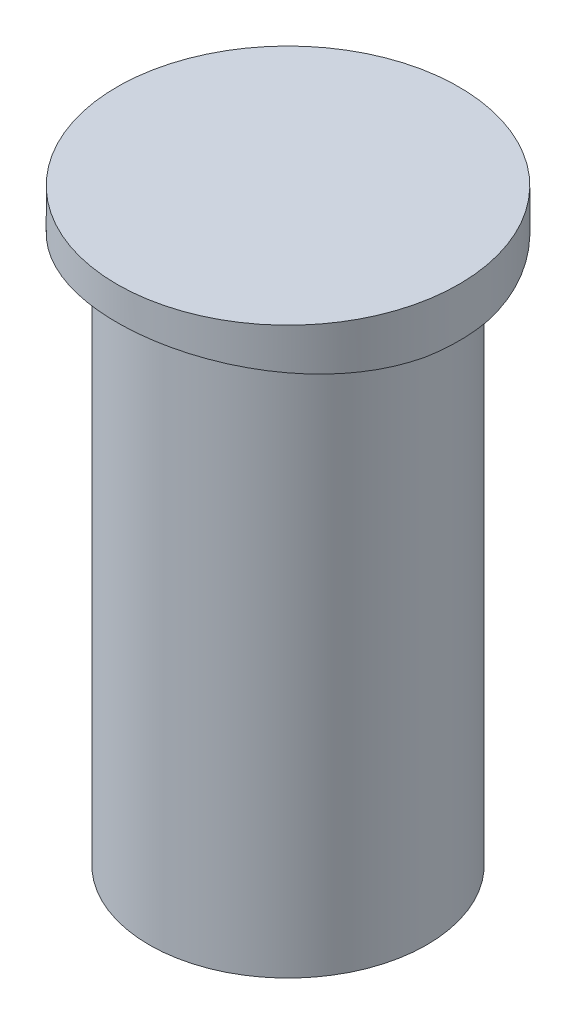
ISO-10303-21;
HEADER;
FILE_DESCRIPTION(('STEP AP214'),'2;1');
FILE_NAME('part.step','',(''),(''),'','','');
FILE_SCHEMA(('AUTOMOTIVE_DESIGN { 1 0 10303 214 1 1 1 1 }'));
ENDSEC;
DATA;
#1=APPLICATION_CONTEXT('core data for automotive mechanical design processes');
#2=APPLICATION_PROTOCOL_DEFINITION('international standard','automotive_design',2000,#1);
#3=PRODUCT_CONTEXT('',#1,'mechanical');
#4=PRODUCT('Part','Part','',(#3));
#5=PRODUCT_RELATED_PRODUCT_CATEGORY('part','',(#4));
#6=PRODUCT_DEFINITION_FORMATION('','',#4);
#7=PRODUCT_DEFINITION_CONTEXT('part definition',#1,'design');
#8=PRODUCT_DEFINITION('design','',#6,#7);
#9=PRODUCT_DEFINITION_SHAPE('','',#8);
#10=(LENGTH_UNIT() NAMED_UNIT(*) SI_UNIT(.MILLI.,.METRE.));
#11=(NAMED_UNIT(*) PLANE_ANGLE_UNIT() SI_UNIT($,.RADIAN.));
#12=(NAMED_UNIT(*) SI_UNIT($,.STERADIAN.) SOLID_ANGLE_UNIT());
#13=UNCERTAINTY_MEASURE_WITH_UNIT(LENGTH_MEASURE(1.E-05),#10,'distance_accuracy_value','');
#14=(GEOMETRIC_REPRESENTATION_CONTEXT(3) GLOBAL_UNCERTAINTY_ASSIGNED_CONTEXT((#13)) GLOBAL_UNIT_ASSIGNED_CONTEXT((#10,
#11,#12)) REPRESENTATION_CONTEXT('',''));
#15=CARTESIAN_POINT('',(0.,0.,0.));
#16=DIRECTION('',(0.,0.,1.));
#17=DIRECTION('',(1.,0.,0.));
#18=AXIS2_PLACEMENT_3D('',#15,#16,#17);
#19=CARTESIAN_POINT('',(0.,26.2128,0.));
#20=DIRECTION('',(0.,-1.,0.));
#21=DIRECTION('',(0.,0.,-1.));
#22=AXIS2_PLACEMENT_3D('',#19,#20,#21);
#23=CYLINDRICAL_SURFACE('',#22,7.62);
#24=CARTESIAN_POINT('',(0.,26.2128,0.));
#25=DIRECTION('',(0.,1.,0.));
#26=DIRECTION('',(0.,0.,1.));
#27=AXIS2_PLACEMENT_3D('',#24,#25,#26);
#28=CIRCLE('',#27,7.62);
#29=CARTESIAN_POINT('',(0.,26.2128,7.62));
#30=VERTEX_POINT('',#29);
#31=EDGE_CURVE('E84',#30,#30,#28,.T.);
#32=ORIENTED_EDGE('',*,*,#31,.F.);
#33=EDGE_LOOP('',(#32));
#34=FACE_BOUND('',#33,.T.);
#35=CARTESIAN_POINT('',(0.,24.0284,0.));
#36=DIRECTION('',(0.,-1.,0.));
#37=DIRECTION('',(0.,0.,-1.));
#38=AXIS2_PLACEMENT_3D('',#35,#36,#37);
#39=CIRCLE('',#38,7.62);
#40=CARTESIAN_POINT('',(7.49777712125401,24.0284,-1.35931535708235));
#41=VERTEX_POINT('',#40);
#42=CARTESIAN_POINT('',(7.49777712125401,24.0284,1.35931535708235));
#43=VERTEX_POINT('',#42);
#44=EDGE_CURVE('E12',#41,#43,#39,.T.);
#45=ORIENTED_EDGE('',*,*,#44,.F.);
#46=CARTESIAN_POINT('',(7.60145996562146,24.0084094535309,-0.531231014770565));
#47=CARTESIAN_POINT('',(7.58664521906398,24.0112734826788,-0.743574984765963));
#48=CARTESIAN_POINT('',(7.5628865936081,24.0158905101815,-0.955261795898511));
#49=CARTESIAN_POINT('',(7.49778431421236,24.0284160184141,-1.37578771761263));
#50=CARTESIAN_POINT('',(7.4564429971873,24.0363240617322,-1.58462720282661));
#51=CARTESIAN_POINT('',(7.35654473256903,24.0552045585585,-1.99768971893656));
#52=CARTESIAN_POINT('',(7.29801224043028,24.0661726578554,-2.20191886688924));
#53=CARTESIAN_POINT('',(7.16416843573644,24.0908520997637,-2.60463188077035));
#54=CARTESIAN_POINT('',(7.08885698679914,24.1045634646727,-2.80311569998495));
#55=CARTESIAN_POINT('',(6.92203005844817,24.134332929158,-3.19293668515689));
#56=CARTESIAN_POINT('',(6.83051669414457,24.1503907223677,-3.38427478002308));
#57=CARTESIAN_POINT('',(6.63191048182801,24.1844025100194,-3.75859960903848));
#58=CARTESIAN_POINT('',(6.52481187745667,24.2023572044015,-3.94158322453849));
#59=CARTESIAN_POINT('',(6.2958536908123,24.2396465872693,-4.2978423859162));
#60=CARTESIAN_POINT('',(6.17399849173473,24.2589808652758,-4.47112079230467));
#61=CARTESIAN_POINT('',(5.91629603702723,24.298503010515,-4.80693817574346));
#62=CARTESIAN_POINT('',(5.78044357466376,24.3186911937273,-4.96947311924289));
#63=CARTESIAN_POINT('',(5.49408753868613,24.3595877226154,-5.28443120625521));
#64=CARTESIAN_POINT('',(5.34343528610684,24.3802993708511,-5.43671877424667));
#65=CARTESIAN_POINT('',(5.02976977722108,24.4214448286672,-5.72814650576097));
#66=CARTESIAN_POINT('',(4.86675195085451,24.4418785322023,-5.86728176537054));
#67=CARTESIAN_POINT('',(4.52952364115873,24.481886749871,-6.1313683670372));
#68=CARTESIAN_POINT('',(4.3553139142099,24.5014613219169,-6.25632066604314));
#69=CARTESIAN_POINT('',(3.99687773153306,24.5392047918952,-6.49116907557979));
#70=CARTESIAN_POINT('',(3.81265119740503,24.5573736788227,-6.60106506824337));
#71=CARTESIAN_POINT('',(3.43478931715503,24.5918556968243,-6.80535900911019));
#72=CARTESIAN_POINT('',(3.2411233502858,24.6081621232035,-6.89970147474016));
#73=CARTESIAN_POINT('',(2.84633505769055,24.6383827896656,-7.07171399153072));
#74=CARTESIAN_POINT('',(2.64521252956916,24.652296964757,-7.14938358974626));
#75=CARTESIAN_POINT('',(2.23701641141498,24.677331020824,-7.28742494168067));
#76=CARTESIAN_POINT('',(2.02994472322203,24.6884517839666,-7.34780215722753));
#77=CARTESIAN_POINT('',(1.61121901878155,24.7075883976523,-7.45083043529028));
#78=CARTESIAN_POINT('',(1.39956346541083,24.7156031890887,-7.49347545165672));
#79=CARTESIAN_POINT('',(0.976440876067232,24.7281973430518,-7.56016907171225));
#80=CARTESIAN_POINT('',(0.765016978891261,24.7328255662944,-7.5844823252036));
#81=CARTESIAN_POINT('',(0.340827390531902,24.7387076089555,-7.61534360243806));
#82=CARTESIAN_POINT('',(0.128061693506159,24.7399614136711,-7.62189154877533));
#83=CARTESIAN_POINT('',(-0.297247391674014,24.7390591400649,-7.61716932123029));
#84=CARTESIAN_POINT('',(-0.509790795998619,24.7369033299535,-7.60590054886423));
#85=CARTESIAN_POINT('',(-0.93313618240053,24.729243052376,-7.56563733412641));
#86=CARTESIAN_POINT('',(-1.14393812198026,24.7237385034325,-7.53664246046587));
#87=CARTESIAN_POINT('',(-1.56015379918455,24.7096078223504,-7.46154047911077));
#88=CARTESIAN_POINT('',(-1.76560048935044,24.7010138822003,-7.41560972377174));
#89=CARTESIAN_POINT('',(-2.17194515067435,24.6809287035489,-7.3069353802776));
#90=CARTESIAN_POINT('',(-2.37284116059095,24.6694362407999,-7.24418468718802));
#91=CARTESIAN_POINT('',(-2.76862844701447,24.6438688371208,-7.10234417085837));
#92=CARTESIAN_POINT('',(-2.96351918821217,24.6297936667416,-7.023252895834));
#93=CARTESIAN_POINT('',(-3.34587544223105,24.5994506028597,-6.84935101995592));
#94=CARTESIAN_POINT('',(-3.53334408017868,24.5831836452056,-6.75454712411903));
#95=CARTESIAN_POINT('',(-3.90155766296138,24.5487172360085,-6.54882991348605));
#96=CARTESIAN_POINT('',(-4.08221499307108,24.5304998370324,-6.43776277992279));
#97=CARTESIAN_POINT('',(-4.43349444909584,24.4927772669481,-6.20107785920705));
#98=CARTESIAN_POINT('',(-4.60412006664457,24.473272548981,-6.07546518051897));
#99=CARTESIAN_POINT('',(-4.9343312112821,24.4334957163316,-5.8104738747348));
#100=CARTESIAN_POINT('',(-5.09391268176615,24.4132233238618,-5.67109023460912));
#101=CARTESIAN_POINT('',(-5.40085063895677,24.3724802972766,-5.37959041624126));
#102=CARTESIAN_POINT('',(-5.54821145315523,24.3520097362275,-5.22747878380961));
#103=CARTESIAN_POINT('',(-5.83193516713075,24.3111155473659,-4.90908243146261));
#104=CARTESIAN_POINT('',(-5.96809610901122,24.2906973946312,-4.74261696643934));
#105=CARTESIAN_POINT('',(-6.22586671702448,24.250817777657,-4.39876534716527));
#106=CARTESIAN_POINT('',(-6.34748170319889,24.2313559651892,-4.2213832217482));
#107=CARTESIAN_POINT('',(-6.57538372329734,24.1939347641777,-3.85680649951189));
#108=CARTESIAN_POINT('',(-6.68166624589128,24.1759758184785,-3.66960903668853));
#109=CARTESIAN_POINT('',(-6.87804165084899,24.1420958829046,-3.28682120914972));
#110=CARTESIAN_POINT('',(-6.96814113563748,24.126174062681,-3.09123430772443));
#111=CARTESIAN_POINT('',(-7.12670842856968,24.0976932914503,-2.70471048194568));
#112=CARTESIAN_POINT('',(-7.19613749186226,24.0849915409202,-2.51417774456657));
#113=CARTESIAN_POINT('',(-7.3196229358713,24.0621348796413,-2.12805223728751));
#114=CARTESIAN_POINT('',(-7.37368020078557,24.0519798224087,-1.93245975913414));
#115=CARTESIAN_POINT('',(-7.46607621335406,24.0344843112086,-1.53729953509802));
#116=CARTESIAN_POINT('',(-7.50440180194003,24.0271462138733,-1.33772860706581));
#117=CARTESIAN_POINT('',(-7.56502214508634,24.0154766511921,-0.936048412085034));
#118=CARTESIAN_POINT('',(-7.5873143461277,24.0111456647703,-0.733938746023273));
#119=CARTESIAN_POINT('',(-7.60145996562146,24.0084094535309,-0.531231014770655));
#120=B_SPLINE_CURVE_WITH_KNOTS('',3,(#46,#47,#48,#49,#50,#51,#52,#53,#54,#55,#56,#57,#58,#59,
#60,#61,#62,#63,#64,#65,#66,#67,#68,#69,#70,#71,#72,#73,#74,#75,#76,#77,#78,#79,#80,#81,#82,#83,
#84,#85,#86,#87,#88,#89,#90,#91,#92,#93,#94,#95,#96,#97,#98,#99,#100,#101,#102,#103,#104,#105,
#106,#107,#108,#109,#110,#111,#112,#113,#114,#115,#116,#117,#118,#119),.UNSPECIFIED.,.F.,.F.,(4,
2,2,2,2,2,2,2,2,2,2,2,2,2,2,2,2,2,2,2,2,2,2,2,2,2,2,2,2,2,2,2,2,2,2,2,4),(0.,0.638431030366087,
1.27677723339447,1.91421971387715,2.55166737578985,3.18903188215546,3.82663239736826,
4.46404398659672,5.1016935435668,5.74657434370566,6.39169465067711,7.03677140436057,
7.68185320768874,8.32918856165005,8.97654149928362,9.62368974334936,10.2710584650214,
10.9088922870554,11.5467288882133,12.1845153177372,12.8223172656807,13.4536571966656,
14.0852642342936,14.7169274114032,15.3483217308366,15.9861280455205,16.6237110351295,
17.2615269846709,17.8991161022696,18.5464271822961,19.1935007859279,19.8407643939005,
20.4877633256872,21.0966702579752,21.7055421583747,22.3149223287841,22.9243995291865),.UNSPECIFIED.);
#121=CARTESIAN_POINT('',(-7.49777712125401,24.0284,-1.35931535708235));
#122=VERTEX_POINT('',#121);
#123=EDGE_CURVE('E89',#41,#122,#120,.T.);
#124=ORIENTED_EDGE('',*,*,#123,.T.);
#125=CARTESIAN_POINT('',(-7.49777712125401,24.0284,1.35931535708235));
#126=VERTEX_POINT('',#125);
#127=EDGE_CURVE('E64',#126,#122,#39,.T.);
#128=ORIENTED_EDGE('',*,*,#127,.F.);
#129=CARTESIAN_POINT('',(-7.60145996562146,24.0084094535309,0.531231014770655));
#130=CARTESIAN_POINT('',(-7.58664521906397,24.0112734826788,0.743574984766052));
#131=CARTESIAN_POINT('',(-7.56288659360809,24.0158905101815,0.9552617958986));
#132=CARTESIAN_POINT('',(-7.49778431421234,24.0284160184141,1.37578771761272));
#133=CARTESIAN_POINT('',(-7.45644299718728,24.0363240617321,1.5846272028267));
#134=CARTESIAN_POINT('',(-7.35654473256901,24.0552045585585,1.99768971893665));
#135=CARTESIAN_POINT('',(-7.29801224043026,24.0661726578554,2.20191886688933));
#136=CARTESIAN_POINT('',(-7.16416843573641,24.0908520997637,2.60463188077043));
#137=CARTESIAN_POINT('',(-7.08885698679911,24.1045634646727,2.80311569998503));
#138=CARTESIAN_POINT('',(-6.92203005844813,24.1343329291581,3.19293668515698));
#139=CARTESIAN_POINT('',(-6.83051669414453,24.1503907223677,3.38427478002316));
#140=CARTESIAN_POINT('',(-6.63191048182796,24.1844025100194,3.75859960903856));
#141=CARTESIAN_POINT('',(-6.52481187745662,24.2023572044015,3.94158322453857));
#142=CARTESIAN_POINT('',(-6.29585369081225,24.2396465872693,4.29784238591627));
#143=CARTESIAN_POINT('',(-6.17399849173468,24.2589808652758,4.47112079230475));
#144=CARTESIAN_POINT('',(-5.91629603702717,24.298503010515,4.80693817574353));
#145=CARTESIAN_POINT('',(-5.7804435746637,24.3186911937273,4.96947311924296));
#146=CARTESIAN_POINT('',(-5.49408753868606,24.3595877226154,5.28443120625527));
#147=CARTESIAN_POINT('',(-5.34343528610677,24.3802993708511,5.43671877424674));
#148=CARTESIAN_POINT('',(-5.02976977722101,24.4214448286672,5.72814650576103));
#149=CARTESIAN_POINT('',(-4.86675195085444,24.4418785322023,5.8672817653706));
#150=CARTESIAN_POINT('',(-4.52952364115866,24.481886749871,6.13136836703726));
#151=CARTESIAN_POINT('',(-4.35531391420982,24.5014613219169,6.2563206660432));
#152=CARTESIAN_POINT('',(-3.99687773153298,24.5392047918952,6.49116907557984));
#153=CARTESIAN_POINT('',(-3.81265119740494,24.5573736788227,6.60106506824341));
#154=CARTESIAN_POINT('',(-3.43478931715494,24.5918556968243,6.80535900911023));
#155=CARTESIAN_POINT('',(-3.24112335028571,24.6081621232035,6.89970147474021));
#156=CARTESIAN_POINT('',(-2.84633505769046,24.6383827896656,7.07171399153075));
#157=CARTESIAN_POINT('',(-2.64521252956907,24.6522969647571,7.14938358974629));
#158=CARTESIAN_POINT('',(-2.23701641141489,24.6773310208241,7.2874249416807));
#159=CARTESIAN_POINT('',(-2.02994472322194,24.6884517839666,7.34780215722756));
#160=CARTESIAN_POINT('',(-1.61121901878146,24.7075883976523,7.4508304352903));
#161=CARTESIAN_POINT('',(-1.39956346541073,24.7156031890887,7.49347545165674));
#162=CARTESIAN_POINT('',(-0.976440876067137,24.7281973430518,7.56016907171226));
#163=CARTESIAN_POINT('',(-0.765016978891166,24.7328255662944,7.58448232520361));
#164=CARTESIAN_POINT('',(-0.340827390531806,24.7387076089555,7.61534360243807));
#165=CARTESIAN_POINT('',(-0.128061693506062,24.7399614136711,7.62189154877533));
#166=CARTESIAN_POINT('',(0.297247391674112,24.7390591400649,7.61716932123028));
#167=CARTESIAN_POINT('',(0.509790795998718,24.7369033299535,7.60590054886422));
#168=CARTESIAN_POINT('',(0.933136182400627,24.729243052376,7.5656373341264));
#169=CARTESIAN_POINT('',(1.14393812198036,24.7237385034325,7.53664246046586));
#170=CARTESIAN_POINT('',(1.56015379918465,24.7096078223504,7.46154047911075));
#171=CARTESIAN_POINT('',(1.76560048935054,24.7010138822003,7.41560972377172));
#172=CARTESIAN_POINT('',(2.17194515067444,24.6809287035489,7.30693538027757));
#173=CARTESIAN_POINT('',(2.37284116059105,24.6694362407999,7.244184687188));
#174=CARTESIAN_POINT('',(2.76862844701456,24.6438688371208,7.10234417085834));
#175=CARTESIAN_POINT('',(2.96351918821226,24.6297936667416,7.02325289583397));
#176=CARTESIAN_POINT('',(3.34587544223114,24.5994506028597,6.84935101995588));
#177=CARTESIAN_POINT('',(3.53334408017877,24.5831836452056,6.75454712411899));
#178=CARTESIAN_POINT('',(3.90155766296146,24.5487172360085,6.548829913486));
#179=CARTESIAN_POINT('',(4.08221499307116,24.5304998370324,6.43776277992274));
#180=CARTESIAN_POINT('',(4.43349444909593,24.4927772669481,6.201077859207));
#181=CARTESIAN_POINT('',(4.60412006664465,24.473272548981,6.07546518051891));
#182=CARTESIAN_POINT('',(4.93433121128217,24.4334957163316,5.81047387473474));
#183=CARTESIAN_POINT('',(5.09391268176622,24.4132233238618,5.67109023460906));
#184=CARTESIAN_POINT('',(5.40085063895684,24.3724802972766,5.37959041624119));
#185=CARTESIAN_POINT('',(5.54821145315529,24.3520097362275,5.22747878380954));
#186=CARTESIAN_POINT('',(5.83193516713081,24.3111155473659,4.90908243146253));
#187=CARTESIAN_POINT('',(5.96809610901128,24.2906973946312,4.74261696643926));
#188=CARTESIAN_POINT('',(6.22586671702454,24.250817777657,4.39876534716519));
#189=CARTESIAN_POINT('',(6.34748170319895,24.2313559651892,4.22138322174811));
#190=CARTESIAN_POINT('',(6.5753837232974,24.1939347641777,3.85680649951181));
#191=CARTESIAN_POINT('',(6.68166624589133,24.1759758184785,3.66960903668844));
#192=CARTESIAN_POINT('',(6.87804165084903,24.1420958829046,3.28682120914963));
#193=CARTESIAN_POINT('',(6.96814113563752,24.126174062681,3.09123430772434));
#194=CARTESIAN_POINT('',(7.12670842856971,24.0976932914503,2.70471048194559));
#195=CARTESIAN_POINT('',(7.19613749186229,24.0849915409202,2.51417774456648));
#196=CARTESIAN_POINT('',(7.31962293587133,24.0621348796413,2.12805223728742));
#197=CARTESIAN_POINT('',(7.3736802007856,24.0519798224087,1.93245975913405));
#198=CARTESIAN_POINT('',(7.46607621335408,24.0344843112086,1.53729953509793));
#199=CARTESIAN_POINT('',(7.50440180194004,24.0271462138733,1.33772860706572));
#200=CARTESIAN_POINT('',(7.56502214508635,24.0154766511921,0.936048412084946));
#201=CARTESIAN_POINT('',(7.58731434612771,24.0111456647703,0.733938746023184));
#202=CARTESIAN_POINT('',(7.60145996562146,24.0084094535309,0.531231014770566));
#203=B_SPLINE_CURVE_WITH_KNOTS('',3,(#129,#130,#131,#132,#133,#134,#135,#136,#137,#138,#139,
#140,#141,#142,#143,#144,#145,#146,#147,#148,#149,#150,#151,#152,#153,#154,#155,#156,#157,#158,
#159,#160,#161,#162,#163,#164,#165,#166,#167,#168,#169,#170,#171,#172,#173,#174,#175,#176,#177,
#178,#179,#180,#181,#182,#183,#184,#185,#186,#187,#188,#189,#190,#191,#192,#193,#194,#195,#196,
#197,#198,#199,#200,#201,#202),.UNSPECIFIED.,.F.,.F.,(4,2,2,2,2,2,2,2,2,2,2,2,2,2,2,2,2,2,2,2,2,
2,2,2,2,2,2,2,2,2,2,2,2,2,2,2,4),(0.,0.638431030366088,1.27677723339447,1.91421971387715,
2.55166737578985,3.18903188215546,3.82663239736826,4.46404398659672,5.10169354356681,
5.74657434370566,6.39169465067711,7.03677140436057,7.68185320768875,8.32918856165006,
8.97654149928362,9.62368974334936,10.2710584650214,10.9088922870555,11.5467288882133,
12.1845153177372,12.8223172656807,13.4536571966656,14.0852642342936,14.7169274114032,
15.3483217308366,15.9861280455205,16.6237110351295,17.2615269846709,17.8991161022696,
18.5464271822961,19.1935007859279,19.8407643939005,20.4877633256872,21.0966702579752,
21.7055421583747,22.3149223287841,22.9243995291865),.UNSPECIFIED.);
#204=EDGE_CURVE('E88',#126,#43,#203,.T.);
#205=ORIENTED_EDGE('',*,*,#204,.T.);
#206=EDGE_LOOP('',(#45,#124,#128,#205));
#207=FACE_BOUND('',#206,.T.);
#208=ADVANCED_FACE('F54',(#34,#207),#23,.T.);
#209=CARTESIAN_POINT('',(0.,-15.1384,-7.62));
#210=DIRECTION('',(0.,0.,1.));
#211=DIRECTION('',(1.,0.,0.));
#212=AXIS2_PLACEMENT_3D('',#209,#210,#211);
#213=CYLINDRICAL_SURFACE('',#212,39.878);
#214=DIRECTION('',(0.,0.,1.));
#215=VECTOR('',#214,1.);
#216=CARTESIAN_POINT('',(7.49777712125401,24.0284,-7.62));
#217=LINE('',#216,#215);
#218=EDGE_CURVE('E63',#43,#41,#217,.F.);
#219=ORIENTED_EDGE('',*,*,#218,.F.);
#220=ORIENTED_EDGE('',*,*,#204,.F.);
#221=DIRECTION('',(0.,0.,1.));
#222=VECTOR('',#221,1.);
#223=CARTESIAN_POINT('',(-7.49777712125401,24.0284,-7.62));
#224=LINE('',#223,#222);
#225=EDGE_CURVE('E77',#122,#126,#224,.T.);
#226=ORIENTED_EDGE('',*,*,#225,.F.);
#227=ORIENTED_EDGE('',*,*,#123,.F.);
#228=EDGE_LOOP('',(#219,#220,#226,#227));
#229=FACE_BOUND('',#228,.T.);
#230=ADVANCED_FACE('F90',(#229),#213,.F.);
#231=CARTESIAN_POINT('',(0.,26.2128,0.));
#232=DIRECTION('',(0.,1.,0.));
#233=DIRECTION('',(0.,0.,1.));
#234=AXIS2_PLACEMENT_3D('',#231,#232,#233);
#235=PLANE('',#234);
#236=ORIENTED_EDGE('',*,*,#31,.T.);
#237=EDGE_LOOP('',(#236));
#238=FACE_BOUND('',#237,.T.);
#239=ADVANCED_FACE('F107',(#238),#235,.T.);
#240=CARTESIAN_POINT('',(0.,24.0284,0.));
#241=DIRECTION('',(0.,-1.,0.));
#242=DIRECTION('',(0.,0.,-1.));
#243=AXIS2_PLACEMENT_3D('',#240,#241,#242);
#244=PLANE('',#243);
#245=ORIENTED_EDGE('',*,*,#225,.T.);
#246=ORIENTED_EDGE('',*,*,#127,.T.);
#247=EDGE_LOOP('',(#245,#246));
#248=FACE_BOUND('',#247,.T.);
#249=ADVANCED_FACE('F79',(#248),#244,.T.);
#250=ORIENTED_EDGE('',*,*,#218,.T.);
#251=ORIENTED_EDGE('',*,*,#44,.T.);
#252=EDGE_LOOP('',(#250,#251));
#253=FACE_BOUND('',#252,.T.);
#254=ADVANCED_FACE('F56',(#253),#244,.T.);
#255=CLOSED_SHELL('',(#208,#230,#239,#249,#254));
#256=MANIFOLD_SOLID_BREP('B2',#255);
#257=CARTESIAN_POINT('',(-7.60145996562146,24.0084094535309,-7.62));
#258=DIRECTION('',(0.,-1.,0.));
#259=DIRECTION('',(0.,0.,-1.));
#260=AXIS2_PLACEMENT_3D('',#257,#258,#259);
#261=PLANE('',#260);
#262=CARTESIAN_POINT('',(0.,24.0084094535309,0.));
#263=DIRECTION('',(0.,-1.,0.));
#264=DIRECTION('',(0.,0.,-1.));
#265=AXIS2_PLACEMENT_3D('',#262,#263,#264);
#266=CIRCLE('',#265,6.1849);
#267=CARTESIAN_POINT('',(0.,24.0084094535309,-6.1849));
#268=VERTEX_POINT('',#267);
#269=EDGE_CURVE('E156',#268,#268,#266,.F.);
#270=ORIENTED_EDGE('',*,*,#269,.T.);
#271=EDGE_LOOP('',(#270));
#272=FACE_BOUND('',#271,.T.);
#273=ADVANCED_FACE('F152',(#272),#261,.F.);
#274=CARTESIAN_POINT('',(0.,0.,0.));
#275=DIRECTION('',(0.,1.,0.));
#276=DIRECTION('',(0.,0.,1.));
#277=AXIS2_PLACEMENT_3D('',#274,#275,#276);
#278=PLANE('',#277);
#279=CARTESIAN_POINT('',(0.,0.,0.));
#280=DIRECTION('',(0.,1.,0.));
#281=DIRECTION('',(0.,0.,1.));
#282=AXIS2_PLACEMENT_3D('',#279,#280,#281);
#283=CIRCLE('',#282,6.1849);
#284=CARTESIAN_POINT('',(0.,0.,6.1849));
#285=VERTEX_POINT('',#284);
#286=EDGE_CURVE('E53',#285,#285,#283,.T.);
#287=ORIENTED_EDGE('',*,*,#286,.F.);
#288=EDGE_LOOP('',(#287));
#289=FACE_BOUND('',#288,.T.);
#290=ADVANCED_FACE('F169',(#289),#278,.F.);
#291=CARTESIAN_POINT('',(0.,23.9776,0.));
#292=DIRECTION('',(0.,-1.,0.));
#293=DIRECTION('',(0.,0.,-1.));
#294=AXIS2_PLACEMENT_3D('',#291,#292,#293);
#295=CYLINDRICAL_SURFACE('',#294,6.1849);
#296=ORIENTED_EDGE('',*,*,#286,.T.);
#297=EDGE_LOOP('',(#296));
#298=FACE_BOUND('',#297,.T.);
#299=ORIENTED_EDGE('',*,*,#269,.F.);
#300=EDGE_LOOP('',(#299));
#301=FACE_BOUND('',#300,.T.);
#302=ADVANCED_FACE('F154',(#298,#301),#295,.T.);
#303=CLOSED_SHELL('',(#273,#290,#302));
#304=MANIFOLD_SOLID_BREP('B6',#303);
#305=ADVANCED_BREP_SHAPE_REPRESENTATION('',(#18,#256,#304),#14);
#306=SHAPE_DEFINITION_REPRESENTATION(#9,#305);
ENDSEC;
END-ISO-10303-21;
